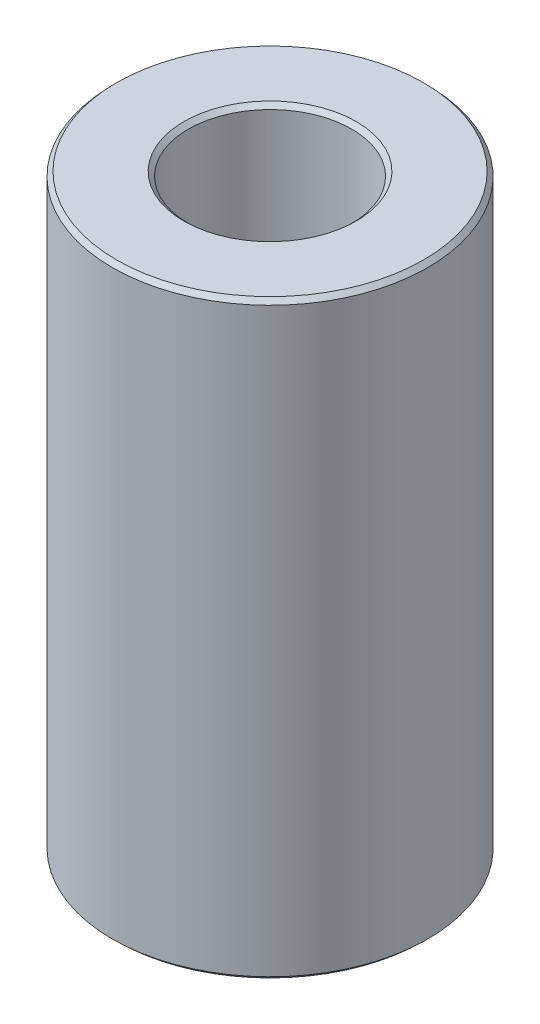
ISO-10303-21;
HEADER;
FILE_DESCRIPTION(('STEP AP214'),'2;1');
FILE_NAME('part.step','',(''),(''),'','','');
FILE_SCHEMA(('AUTOMOTIVE_DESIGN { 1 0 10303 214 1 1 1 1 }'));
ENDSEC;
DATA;
#1=APPLICATION_CONTEXT('core data for automotive mechanical design processes');
#2=APPLICATION_PROTOCOL_DEFINITION('international standard','automotive_design',2000,#1);
#3=PRODUCT_CONTEXT('',#1,'mechanical');
#4=PRODUCT('Part','Part','',(#3));
#5=PRODUCT_RELATED_PRODUCT_CATEGORY('part','',(#4));
#6=PRODUCT_DEFINITION_FORMATION('','',#4);
#7=PRODUCT_DEFINITION_CONTEXT('part definition',#1,'design');
#8=PRODUCT_DEFINITION('design','',#6,#7);
#9=PRODUCT_DEFINITION_SHAPE('','',#8);
#10=(LENGTH_UNIT() NAMED_UNIT(*) SI_UNIT(.MILLI.,.METRE.));
#11=(NAMED_UNIT(*) PLANE_ANGLE_UNIT() SI_UNIT($,.RADIAN.));
#12=(NAMED_UNIT(*) SI_UNIT($,.STERADIAN.) SOLID_ANGLE_UNIT());
#13=UNCERTAINTY_MEASURE_WITH_UNIT(LENGTH_MEASURE(1.E-05),#10,'distance_accuracy_value','');
#14=(GEOMETRIC_REPRESENTATION_CONTEXT(3) GLOBAL_UNCERTAINTY_ASSIGNED_CONTEXT((#13)) GLOBAL_UNIT_ASSIGNED_CONTEXT((#10,
#11,#12)) REPRESENTATION_CONTEXT('',''));
#15=CARTESIAN_POINT('',(0.,0.,0.));
#16=DIRECTION('',(0.,0.,1.));
#17=DIRECTION('',(1.,0.,0.));
#18=AXIS2_PLACEMENT_3D('',#15,#16,#17);
#19=CARTESIAN_POINT('',(0.,168.385763559248,0.));
#20=DIRECTION('',(0.,-1.,0.));
#21=DIRECTION('',(0.,0.,-1.));
#22=AXIS2_PLACEMENT_3D('',#19,#20,#21);
#23=CYLINDRICAL_SURFACE('',#22,45.);
#24=CARTESIAN_POINT('',(0.,1.21005734455709,0.));
#25=DIRECTION('',(0.,1.,0.));
#26=DIRECTION('',(0.,0.,1.));
#27=AXIS2_PLACEMENT_3D('',#24,#25,#26);
#28=CIRCLE('',#27,45.);
#29=CARTESIAN_POINT('',(0.,1.21005734455709,45.));
#30=VERTEX_POINT('',#29);
#31=EDGE_CURVE('E10',#30,#30,#28,.T.);
#32=ORIENTED_EDGE('',*,*,#31,.T.);
#33=EDGE_LOOP('',(#32));
#34=FACE_BOUND('',#33,.T.);
#35=CARTESIAN_POINT('',(0.,167.103161250464,0.));
#36=DIRECTION('',(0.,1.,0.));
#37=DIRECTION('',(0.,0.,1.));
#38=AXIS2_PLACEMENT_3D('',#35,#36,#37);
#39=CIRCLE('',#38,45.);
#40=CARTESIAN_POINT('',(0.,167.103161250464,45.));
#41=VERTEX_POINT('',#40);
#42=EDGE_CURVE('E50',#41,#41,#39,.F.);
#43=ORIENTED_EDGE('',*,*,#42,.T.);
#44=EDGE_LOOP('',(#43));
#45=FACE_BOUND('',#44,.T.);
#46=ADVANCED_FACE('F39',(#34,#45),#23,.T.);
#47=CARTESIAN_POINT('',(0.,168.385763559248,0.));
#48=DIRECTION('',(0.,1.,0.));
#49=DIRECTION('',(0.,0.,1.));
#50=AXIS2_PLACEMENT_3D('',#47,#48,#49);
#51=PLANE('',#50);
#52=CARTESIAN_POINT('',(0.,168.385763559248,0.));
#53=DIRECTION('',(0.,1.,0.));
#54=DIRECTION('',(0.,0.,1.));
#55=AXIS2_PLACEMENT_3D('',#52,#53,#54);
#56=CIRCLE('',#55,24.5930649168236);
#57=CARTESIAN_POINT('',(0.,168.385763559248,24.5930649168236));
#58=VERTEX_POINT('',#57);
#59=EDGE_CURVE('E58',#58,#58,#56,.F.);
#60=ORIENTED_EDGE('',*,*,#59,.T.);
#61=EDGE_LOOP('',(#60));
#62=FACE_BOUND('',#61,.T.);
#63=CARTESIAN_POINT('',(0.,168.385763559248,0.));
#64=DIRECTION('',(0.,1.,0.));
#65=DIRECTION('',(0.,0.,1.));
#66=AXIS2_PLACEMENT_3D('',#63,#64,#65);
#67=CIRCLE('',#66,43.7899426554428);
#68=CARTESIAN_POINT('',(0.,168.385763559248,43.7899426554428));
#69=VERTEX_POINT('',#68);
#70=EDGE_CURVE('E61',#69,#69,#67,.T.);
#71=ORIENTED_EDGE('',*,*,#70,.T.);
#72=EDGE_LOOP('',(#71));
#73=FACE_BOUND('',#72,.T.);
#74=ADVANCED_FACE('F88',(#62,#73),#51,.T.);
#75=CARTESIAN_POINT('',(0.,0.,0.));
#76=DIRECTION('',(0.,1.,0.));
#77=DIRECTION('',(0.,0.,1.));
#78=AXIS2_PLACEMENT_3D('',#75,#76,#77);
#79=PLANE('',#78);
#80=CARTESIAN_POINT('',(0.,0.,0.));
#81=DIRECTION('',(0.,1.,0.));
#82=DIRECTION('',(0.,0.,1.));
#83=AXIS2_PLACEMENT_3D('',#80,#81,#82);
#84=CIRCLE('',#83,24.5205199525969);
#85=CARTESIAN_POINT('',(0.,0.,24.5205199525969));
#86=VERTEX_POINT('',#85);
#87=EDGE_CURVE('E51',#86,#86,#84,.T.);
#88=ORIENTED_EDGE('',*,*,#87,.T.);
#89=EDGE_LOOP('',(#88));
#90=FACE_BOUND('',#89,.T.);
#91=CARTESIAN_POINT('',(0.,0.,0.));
#92=DIRECTION('',(0.,1.,0.));
#93=DIRECTION('',(0.,0.,1.));
#94=AXIS2_PLACEMENT_3D('',#91,#92,#93);
#95=CIRCLE('',#94,43.7173976912162);
#96=CARTESIAN_POINT('',(0.,0.,43.7173976912162));
#97=VERTEX_POINT('',#96);
#98=EDGE_CURVE('E54',#97,#97,#95,.F.);
#99=ORIENTED_EDGE('',*,*,#98,.T.);
#100=EDGE_LOOP('',(#99));
#101=FACE_BOUND('',#100,.T.);
#102=ADVANCED_FACE('F83',(#90,#101),#79,.F.);
#103=CARTESIAN_POINT('',(0.,168.385763559248,0.));
#104=DIRECTION('',(0.,-1.,0.));
#105=DIRECTION('',(0.,0.,-1.));
#106=AXIS2_PLACEMENT_3D('',#103,#104,#105);
#107=CYLINDRICAL_SURFACE('',#106,23.3104626080397);
#108=CARTESIAN_POINT('',(0.,167.175706214691,0.));
#109=DIRECTION('',(0.,1.,0.));
#110=DIRECTION('',(0.,0.,1.));
#111=AXIS2_PLACEMENT_3D('',#108,#109,#110);
#112=CIRCLE('',#111,23.3104626080397);
#113=CARTESIAN_POINT('',(0.,167.175706214691,23.3104626080397));
#114=VERTEX_POINT('',#113);
#115=EDGE_CURVE('E67',#114,#114,#112,.T.);
#116=ORIENTED_EDGE('',*,*,#115,.T.);
#117=EDGE_LOOP('',(#116));
#118=FACE_BOUND('',#117,.T.);
#119=CARTESIAN_POINT('',(0.,1.28260230878385,0.));
#120=DIRECTION('',(0.,1.,0.));
#121=DIRECTION('',(0.,0.,1.));
#122=AXIS2_PLACEMENT_3D('',#119,#120,#121);
#123=CIRCLE('',#122,23.3104626080397);
#124=CARTESIAN_POINT('',(0.,1.28260230878385,23.3104626080397));
#125=VERTEX_POINT('',#124);
#126=EDGE_CURVE('E69',#125,#125,#123,.F.);
#127=ORIENTED_EDGE('',*,*,#126,.T.);
#128=EDGE_LOOP('',(#127));
#129=FACE_BOUND('',#128,.T.);
#130=ADVANCED_FACE('F71',(#118,#129),#107,.F.);
#131=CARTESIAN_POINT('',(0.,167.175706214691,0.));
#132=DIRECTION('',(0.,1.,0.));
#133=DIRECTION('',(0.,0.,1.));
#134=AXIS2_PLACEMENT_3D('',#131,#132,#133);
#135=CONICAL_SURFACE('',#134,23.3104626080397,0.81449338802119);
#136=ORIENTED_EDGE('',*,*,#59,.F.);
#137=EDGE_LOOP('',(#136));
#138=FACE_BOUND('',#137,.T.);
#139=ORIENTED_EDGE('',*,*,#115,.F.);
#140=EDGE_LOOP('',(#139));
#141=FACE_BOUND('',#140,.T.);
#142=ADVANCED_FACE('F77',(#138,#141),#135,.F.);
#143=CARTESIAN_POINT('',(0.,0.,0.));
#144=DIRECTION('',(0.,-1.,0.));
#145=DIRECTION('',(0.,0.,-1.));
#146=AXIS2_PLACEMENT_3D('',#143,#144,#145);
#147=CONICAL_SURFACE('',#146,24.5205199525969,0.756302938773702);
#148=ORIENTED_EDGE('',*,*,#126,.F.);
#149=EDGE_LOOP('',(#148));
#150=FACE_BOUND('',#149,.T.);
#151=ORIENTED_EDGE('',*,*,#87,.F.);
#152=EDGE_LOOP('',(#151));
#153=FACE_BOUND('',#152,.T.);
#154=ADVANCED_FACE('F73',(#150,#153),#147,.F.);
#155=CARTESIAN_POINT('',(0.,1.21005734455709,0.));
#156=DIRECTION('',(0.,1.,0.));
#157=DIRECTION('',(0.,0.,1.));
#158=AXIS2_PLACEMENT_3D('',#155,#156,#157);
#159=CONICAL_SURFACE('',#158,45.,0.814493388021192);
#160=ORIENTED_EDGE('',*,*,#98,.F.);
#161=EDGE_LOOP('',(#160));
#162=FACE_BOUND('',#161,.T.);
#163=ORIENTED_EDGE('',*,*,#31,.F.);
#164=EDGE_LOOP('',(#163));
#165=FACE_BOUND('',#164,.T.);
#166=ADVANCED_FACE('F76',(#162,#165),#159,.T.);
#167=CARTESIAN_POINT('',(0.,168.385763559248,0.));
#168=DIRECTION('',(0.,-1.,0.));
#169=DIRECTION('',(0.,0.,-1.));
#170=AXIS2_PLACEMENT_3D('',#167,#168,#169);
#171=CONICAL_SURFACE('',#170,43.7899426554428,0.75630293877369);
#172=ORIENTED_EDGE('',*,*,#42,.F.);
#173=EDGE_LOOP('',(#172));
#174=FACE_BOUND('',#173,.T.);
#175=ORIENTED_EDGE('',*,*,#70,.F.);
#176=EDGE_LOOP('',(#175));
#177=FACE_BOUND('',#176,.T.);
#178=ADVANCED_FACE('F45',(#174,#177),#171,.T.);
#179=CLOSED_SHELL('',(#46,#74,#102,#130,#142,#154,#166,#178));
#180=MANIFOLD_SOLID_BREP('B2',#179);
#181=ADVANCED_BREP_SHAPE_REPRESENTATION('',(#18,#180),#14);
#182=SHAPE_DEFINITION_REPRESENTATION(#9,#181);
ENDSEC;
END-ISO-10303-21;
